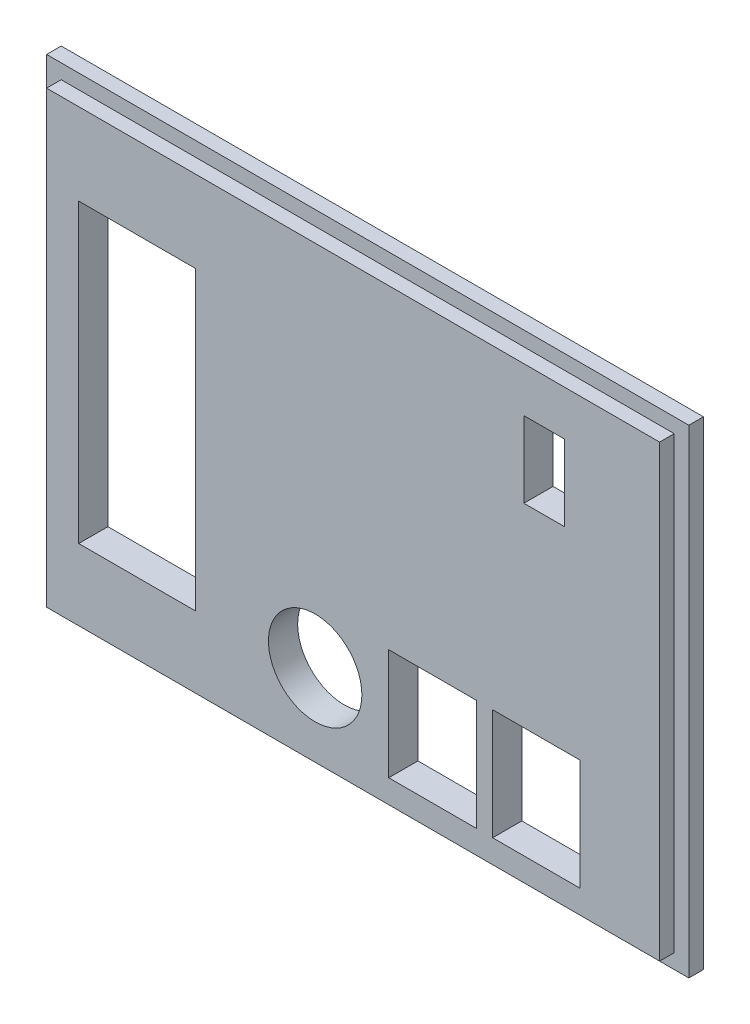
ISO-10303-21;
HEADER;
FILE_DESCRIPTION(('STEP AP214'),'2;1');
FILE_NAME('part.step','',(''),(''),'','','');
FILE_SCHEMA(('AUTOMOTIVE_DESIGN { 1 0 10303 214 1 1 1 1 }'));
ENDSEC;
DATA;
#1=APPLICATION_CONTEXT('core data for automotive mechanical design processes');
#2=APPLICATION_PROTOCOL_DEFINITION('international standard','automotive_design',2000,#1);
#3=PRODUCT_CONTEXT('',#1,'mechanical');
#4=PRODUCT('Part','Part','',(#3));
#5=PRODUCT_RELATED_PRODUCT_CATEGORY('part','',(#4));
#6=PRODUCT_DEFINITION_FORMATION('','',#4);
#7=PRODUCT_DEFINITION_CONTEXT('part definition',#1,'design');
#8=PRODUCT_DEFINITION('design','',#6,#7);
#9=PRODUCT_DEFINITION_SHAPE('','',#8);
#10=(LENGTH_UNIT() NAMED_UNIT(*) SI_UNIT(.MILLI.,.METRE.));
#11=(NAMED_UNIT(*) PLANE_ANGLE_UNIT() SI_UNIT($,.RADIAN.));
#12=(NAMED_UNIT(*) SI_UNIT($,.STERADIAN.) SOLID_ANGLE_UNIT());
#13=UNCERTAINTY_MEASURE_WITH_UNIT(LENGTH_MEASURE(1.E-05),#10,'distance_accuracy_value','');
#14=(GEOMETRIC_REPRESENTATION_CONTEXT(3) GLOBAL_UNCERTAINTY_ASSIGNED_CONTEXT((#13)) GLOBAL_UNIT_ASSIGNED_CONTEXT((#10,
#11,#12)) REPRESENTATION_CONTEXT('',''));
#15=CARTESIAN_POINT('',(0.,0.,0.));
#16=DIRECTION('',(0.,0.,1.));
#17=DIRECTION('',(1.,0.,0.));
#18=AXIS2_PLACEMENT_3D('',#15,#16,#17);
#19=CARTESIAN_POINT('',(0.,0.,5.));
#20=DIRECTION('',(0.,0.,-1.));
#21=DIRECTION('',(-1.,0.,0.));
#22=AXIS2_PLACEMENT_3D('',#19,#20,#21);
#23=PLANE('',#22);
#24=DIRECTION('',(0.,-1.,0.));
#25=VECTOR('',#24,1.);
#26=CARTESIAN_POINT('',(21.1,0.,5.));
#27=LINE('',#26,#25);
#28=CARTESIAN_POINT('',(21.1,-15.4998771673161,5.));
#29=VERTEX_POINT('',#28);
#30=CARTESIAN_POINT('',(21.1,-34.4998771673161,5.));
#31=VERTEX_POINT('',#30);
#32=EDGE_CURVE('E257',#29,#31,#27,.T.);
#33=ORIENTED_EDGE('',*,*,#32,.T.);
#34=DIRECTION('',(1.,0.,0.));
#35=VECTOR('',#34,1.);
#36=CARTESIAN_POINT('',(0.,-34.4998771673161,5.));
#37=LINE('',#36,#35);
#38=CARTESIAN_POINT('',(6.09999999999999,-34.4998771673161,5.));
#39=VERTEX_POINT('',#38);
#40=EDGE_CURVE('E278',#39,#31,#37,.T.);
#41=ORIENTED_EDGE('',*,*,#40,.F.);
#42=DIRECTION('',(0.,-1.,0.));
#43=VECTOR('',#42,1.);
#44=CARTESIAN_POINT('',(6.09999999999999,0.,5.));
#45=LINE('',#44,#43);
#46=CARTESIAN_POINT('',(6.09999999999999,-15.4998771673161,5.));
#47=VERTEX_POINT('',#46);
#48=EDGE_CURVE('E274',#47,#39,#45,.T.);
#49=ORIENTED_EDGE('',*,*,#48,.F.);
#50=DIRECTION('',(1.,0.,0.));
#51=VECTOR('',#50,1.);
#52=CARTESIAN_POINT('',(0.,-15.4998771673161,5.));
#53=LINE('',#52,#51);
#54=EDGE_CURVE('E270',#47,#29,#53,.T.);
#55=ORIENTED_EDGE('',*,*,#54,.T.);
#56=EDGE_LOOP('',(#33,#41,#49,#55));
#57=FACE_BOUND('',#56,.T.);
#58=DIRECTION('',(-1.,0.,0.));
#59=VECTOR('',#58,1.);
#60=CARTESIAN_POINT('',(0.,24.5,5.));
#61=LINE('',#60,#59);
#62=CARTESIAN_POINT('',(-26.9729243703699,24.5,5.));
#63=VERTEX_POINT('',#62);
#64=CARTESIAN_POINT('',(-47.,24.5,5.));
#65=VERTEX_POINT('',#64);
#66=EDGE_CURVE('E371',#63,#65,#61,.T.);
#67=ORIENTED_EDGE('',*,*,#66,.F.);
#68=DIRECTION('',(0.,1.,0.));
#69=VECTOR('',#68,1.);
#70=CARTESIAN_POINT('',(-26.9729243703699,0.,5.));
#71=LINE('',#70,#69);
#72=CARTESIAN_POINT('',(-26.9729243703699,-26.3,5.));
#73=VERTEX_POINT('',#72);
#74=EDGE_CURVE('E347',#73,#63,#71,.T.);
#75=ORIENTED_EDGE('',*,*,#74,.F.);
#76=DIRECTION('',(1.,0.,0.));
#77=VECTOR('',#76,1.);
#78=CARTESIAN_POINT('',(0.,-26.3,5.));
#79=LINE('',#78,#77);
#80=CARTESIAN_POINT('',(-47.,-26.3,5.));
#81=VERTEX_POINT('',#80);
#82=EDGE_CURVE('E356',#81,#73,#79,.T.);
#83=ORIENTED_EDGE('',*,*,#82,.F.);
#84=DIRECTION('',(0.,-1.,0.));
#85=VECTOR('',#84,1.);
#86=CARTESIAN_POINT('',(-47.,0.,5.));
#87=LINE('',#86,#85);
#88=EDGE_CURVE('E375',#65,#81,#87,.T.);
#89=ORIENTED_EDGE('',*,*,#88,.F.);
#90=EDGE_LOOP('',(#67,#75,#83,#89));
#91=FACE_BOUND('',#90,.T.);
#92=DIRECTION('',(-1.,0.,0.));
#93=VECTOR('',#92,1.);
#94=CARTESIAN_POINT('',(-52.5016459675633,-38.4998771673161,5.));
#95=LINE('',#94,#93);
#96=CARTESIAN_POINT('',(52.5,-38.4998771673161,5.));
#97=VERTEX_POINT('',#96);
#98=CARTESIAN_POINT('',(-52.5016459675633,-38.4998771673161,5.));
#99=VERTEX_POINT('',#98);
#100=EDGE_CURVE('E320',#97,#99,#95,.T.);
#101=ORIENTED_EDGE('',*,*,#100,.F.);
#102=DIRECTION('',(0.,-1.,0.));
#103=VECTOR('',#102,1.);
#104=CARTESIAN_POINT('',(52.5,38.4982965441038,5.));
#105=LINE('',#104,#103);
#106=CARTESIAN_POINT('',(52.5,38.4982965441038,5.));
#107=VERTEX_POINT('',#106);
#108=EDGE_CURVE('E286',#107,#97,#105,.T.);
#109=ORIENTED_EDGE('',*,*,#108,.F.);
#110=DIRECTION('',(1.,0.,0.));
#111=VECTOR('',#110,1.);
#112=CARTESIAN_POINT('',(-52.5016459675633,38.4982965441038,5.));
#113=LINE('',#112,#111);
#114=CARTESIAN_POINT('',(-52.5016459675633,38.4982965441038,5.));
#115=VERTEX_POINT('',#114);
#116=EDGE_CURVE('E307',#115,#107,#113,.T.);
#117=ORIENTED_EDGE('',*,*,#116,.F.);
#118=DIRECTION('',(0.,1.,0.));
#119=VECTOR('',#118,1.);
#120=CARTESIAN_POINT('',(-52.5016459675633,41.,5.));
#121=LINE('',#120,#119);
#122=EDGE_CURVE('E333',#99,#115,#121,.T.);
#123=ORIENTED_EDGE('',*,*,#122,.F.);
#124=EDGE_LOOP('',(#101,#109,#117,#123));
#125=FACE_BOUND('',#124,.T.);
#126=DIRECTION('',(0.,-1.,0.));
#127=VECTOR('',#126,1.);
#128=CARTESIAN_POINT('',(38.9,0.,5.));
#129=LINE('',#128,#127);
#130=CARTESIAN_POINT('',(38.9,-15.4998771673161,5.));
#131=VERTEX_POINT('',#130);
#132=CARTESIAN_POINT('',(38.9,-34.4998771673161,5.));
#133=VERTEX_POINT('',#132);
#134=EDGE_CURVE('E241',#131,#133,#129,.T.);
#135=ORIENTED_EDGE('',*,*,#134,.T.);
#136=DIRECTION('',(1.,0.,0.));
#137=VECTOR('',#136,1.);
#138=CARTESIAN_POINT('',(0.,-34.4998771673161,5.));
#139=LINE('',#138,#137);
#140=CARTESIAN_POINT('',(23.9,-34.4998771673161,5.));
#141=VERTEX_POINT('',#140);
#142=EDGE_CURVE('E238',#141,#133,#139,.T.);
#143=ORIENTED_EDGE('',*,*,#142,.F.);
#144=DIRECTION('',(0.,-1.,0.));
#145=VECTOR('',#144,1.);
#146=CARTESIAN_POINT('',(23.9,0.,5.));
#147=LINE('',#146,#145);
#148=CARTESIAN_POINT('',(23.9,-15.4998771673161,5.));
#149=VERTEX_POINT('',#148);
#150=EDGE_CURVE('E249',#149,#141,#147,.T.);
#151=ORIENTED_EDGE('',*,*,#150,.F.);
#152=DIRECTION('',(1.,0.,0.));
#153=VECTOR('',#152,1.);
#154=CARTESIAN_POINT('',(0.,-15.4998771673161,5.));
#155=LINE('',#154,#153);
#156=EDGE_CURVE('E245',#149,#131,#155,.T.);
#157=ORIENTED_EDGE('',*,*,#156,.T.);
#158=EDGE_LOOP('',(#135,#143,#151,#157));
#159=FACE_BOUND('',#158,.T.);
#160=CARTESIAN_POINT('',(-6.50164596756334,-24.4998771673161,5.));
#161=DIRECTION('',(0.,0.,1.));
#162=DIRECTION('',(1.,0.,0.));
#163=AXIS2_PLACEMENT_3D('',#160,#161,#162);
#164=CIRCLE('',#163,8.);
#165=CARTESIAN_POINT('',(1.49835403243666,-24.4998771673161,5.));
#166=VERTEX_POINT('',#165);
#167=EDGE_CURVE('E229',#166,#166,#164,.T.);
#168=ORIENTED_EDGE('',*,*,#167,.F.);
#169=EDGE_LOOP('',(#168));
#170=FACE_BOUND('',#169,.T.);
#171=DIRECTION('',(1.,0.,0.));
#172=VECTOR('',#171,1.);
#173=CARTESIAN_POINT('',(0.,30.7982965441038,5.));
#174=LINE('',#173,#172);
#175=CARTESIAN_POINT('',(29.25,30.7982965441038,5.));
#176=VERTEX_POINT('',#175);
#177=CARTESIAN_POINT('',(36.25,30.7982965441038,5.));
#178=VERTEX_POINT('',#177);
#179=EDGE_CURVE('E54',#176,#178,#174,.T.);
#180=ORIENTED_EDGE('',*,*,#179,.T.);
#181=DIRECTION('',(0.,-1.,0.));
#182=VECTOR('',#181,1.);
#183=CARTESIAN_POINT('',(36.25,0.,5.));
#184=LINE('',#183,#182);
#185=CARTESIAN_POINT('',(36.25,17.7982965441038,5.));
#186=VERTEX_POINT('',#185);
#187=EDGE_CURVE('E219',#178,#186,#184,.T.);
#188=ORIENTED_EDGE('',*,*,#187,.T.);
#189=DIRECTION('',(-1.,0.,0.));
#190=VECTOR('',#189,1.);
#191=CARTESIAN_POINT('',(0.,17.7982965441038,5.));
#192=LINE('',#191,#190);
#193=CARTESIAN_POINT('',(29.25,17.7982965441038,5.));
#194=VERTEX_POINT('',#193);
#195=EDGE_CURVE('E203',#186,#194,#192,.T.);
#196=ORIENTED_EDGE('',*,*,#195,.T.);
#197=DIRECTION('',(0.,1.,0.));
#198=VECTOR('',#197,1.);
#199=CARTESIAN_POINT('',(29.25,0.,5.));
#200=LINE('',#199,#198);
#201=EDGE_CURVE('E213',#194,#176,#200,.T.);
#202=ORIENTED_EDGE('',*,*,#201,.T.);
#203=EDGE_LOOP('',(#180,#188,#196,#202));
#204=FACE_BOUND('',#203,.T.);
#205=ADVANCED_FACE('F38',(#57,#91,#125,#159,#170,#204),#23,.F.);
#206=CARTESIAN_POINT('',(0.,0.,0.));
#207=DIRECTION('',(0.,0.,-1.));
#208=DIRECTION('',(-1.,0.,0.));
#209=AXIS2_PLACEMENT_3D('',#206,#207,#208);
#210=PLANE('',#209);
#211=CARTESIAN_POINT('',(-6.50164596756334,-24.4998771673161,0.));
#212=DIRECTION('',(0.,0.,-1.));
#213=DIRECTION('',(-1.,0.,0.));
#214=AXIS2_PLACEMENT_3D('',#211,#212,#213);
#215=CIRCLE('',#214,8.);
#216=CARTESIAN_POINT('',(-14.5016459675633,-24.4998771673161,0.));
#217=VERTEX_POINT('',#216);
#218=EDGE_CURVE('E237',#217,#217,#215,.T.);
#219=ORIENTED_EDGE('',*,*,#218,.F.);
#220=EDGE_LOOP('',(#219));
#221=FACE_BOUND('',#220,.T.);
#222=DIRECTION('',(-1.,0.,0.));
#223=VECTOR('',#222,1.);
#224=CARTESIAN_POINT('',(0.,-34.4998771673161,0.));
#225=LINE('',#224,#223);
#226=CARTESIAN_POINT('',(38.9,-34.4998771673161,0.));
#227=VERTEX_POINT('',#226);
#228=CARTESIAN_POINT('',(23.9,-34.4998771673161,0.));
#229=VERTEX_POINT('',#228);
#230=EDGE_CURVE('E448',#227,#229,#225,.T.);
#231=ORIENTED_EDGE('',*,*,#230,.F.);
#232=DIRECTION('',(0.,1.,0.));
#233=VECTOR('',#232,1.);
#234=CARTESIAN_POINT('',(38.9,0.,0.));
#235=LINE('',#234,#233);
#236=CARTESIAN_POINT('',(38.9,-15.4998771673161,0.));
#237=VERTEX_POINT('',#236);
#238=EDGE_CURVE('E437',#227,#237,#235,.T.);
#239=ORIENTED_EDGE('',*,*,#238,.T.);
#240=DIRECTION('',(-1.,0.,0.));
#241=VECTOR('',#240,1.);
#242=CARTESIAN_POINT('',(0.,-15.4998771673161,0.));
#243=LINE('',#242,#241);
#244=CARTESIAN_POINT('',(23.9,-15.4998771673161,0.));
#245=VERTEX_POINT('',#244);
#246=EDGE_CURVE('E441',#237,#245,#243,.T.);
#247=ORIENTED_EDGE('',*,*,#246,.T.);
#248=DIRECTION('',(0.,1.,0.));
#249=VECTOR('',#248,1.);
#250=CARTESIAN_POINT('',(23.9,0.,0.));
#251=LINE('',#250,#249);
#252=EDGE_CURVE('E445',#229,#245,#251,.T.);
#253=ORIENTED_EDGE('',*,*,#252,.F.);
#254=EDGE_LOOP('',(#231,#239,#247,#253));
#255=FACE_BOUND('',#254,.T.);
#256=DIRECTION('',(0.,1.,0.));
#257=VECTOR('',#256,1.);
#258=CARTESIAN_POINT('',(-26.9729243703699,0.,0.));
#259=LINE('',#258,#257);
#260=CARTESIAN_POINT('',(-26.9729243703699,-26.3,0.));
#261=VERTEX_POINT('',#260);
#262=CARTESIAN_POINT('',(-26.9729243703699,24.5,0.));
#263=VERTEX_POINT('',#262);
#264=EDGE_CURVE('E351',#261,#263,#259,.T.);
#265=ORIENTED_EDGE('',*,*,#264,.T.);
#266=DIRECTION('',(-1.,0.,0.));
#267=VECTOR('',#266,1.);
#268=CARTESIAN_POINT('',(0.,24.5,0.));
#269=LINE('',#268,#267);
#270=CARTESIAN_POINT('',(-47.,24.5,0.));
#271=VERTEX_POINT('',#270);
#272=EDGE_CURVE('E355',#263,#271,#269,.T.);
#273=ORIENTED_EDGE('',*,*,#272,.T.);
#274=DIRECTION('',(0.,-1.,0.));
#275=VECTOR('',#274,1.);
#276=CARTESIAN_POINT('',(-47.,0.,0.));
#277=LINE('',#276,#275);
#278=CARTESIAN_POINT('',(-47.,-26.3,0.));
#279=VERTEX_POINT('',#278);
#280=EDGE_CURVE('E360',#271,#279,#277,.T.);
#281=ORIENTED_EDGE('',*,*,#280,.T.);
#282=DIRECTION('',(1.,0.,0.));
#283=VECTOR('',#282,1.);
#284=CARTESIAN_POINT('',(0.,-26.3,0.));
#285=LINE('',#284,#283);
#286=EDGE_CURVE('E364',#279,#261,#285,.T.);
#287=ORIENTED_EDGE('',*,*,#286,.T.);
#288=EDGE_LOOP('',(#265,#273,#281,#287));
#289=FACE_BOUND('',#288,.T.);
#290=DIRECTION('',(0.,-1.,0.));
#291=VECTOR('',#290,1.);
#292=CARTESIAN_POINT('',(-55.,41.,0.));
#293=LINE('',#292,#291);
#294=CARTESIAN_POINT('',(-55.,41.,0.));
#295=VERTEX_POINT('',#294);
#296=CARTESIAN_POINT('',(-55.,-41.,0.));
#297=VERTEX_POINT('',#296);
#298=EDGE_CURVE('E385',#295,#297,#293,.T.);
#299=ORIENTED_EDGE('',*,*,#298,.F.);
#300=DIRECTION('',(-1.,0.,0.));
#301=VECTOR('',#300,1.);
#302=CARTESIAN_POINT('',(55.,41.,0.));
#303=LINE('',#302,#301);
#304=CARTESIAN_POINT('',(55.,41.,0.));
#305=VERTEX_POINT('',#304);
#306=EDGE_CURVE('E406',#305,#295,#303,.T.);
#307=ORIENTED_EDGE('',*,*,#306,.F.);
#308=DIRECTION('',(0.,1.,0.));
#309=VECTOR('',#308,1.);
#310=CARTESIAN_POINT('',(55.,41.,0.));
#311=LINE('',#310,#309);
#312=CARTESIAN_POINT('',(55.,-41.,0.));
#313=VERTEX_POINT('',#312);
#314=EDGE_CURVE('E402',#313,#305,#311,.T.);
#315=ORIENTED_EDGE('',*,*,#314,.F.);
#316=DIRECTION('',(1.,0.,0.));
#317=VECTOR('',#316,1.);
#318=CARTESIAN_POINT('',(55.,-41.,0.));
#319=LINE('',#318,#317);
#320=EDGE_CURVE('E398',#297,#313,#319,.T.);
#321=ORIENTED_EDGE('',*,*,#320,.F.);
#322=EDGE_LOOP('',(#299,#307,#315,#321));
#323=FACE_BOUND('',#322,.T.);
#324=DIRECTION('',(-1.,0.,0.));
#325=VECTOR('',#324,1.);
#326=CARTESIAN_POINT('',(0.,-34.4998771673161,0.));
#327=LINE('',#326,#325);
#328=CARTESIAN_POINT('',(21.1,-34.4998771673161,0.));
#329=VERTEX_POINT('',#328);
#330=CARTESIAN_POINT('',(6.09999999999999,-34.4998771673161,0.));
#331=VERTEX_POINT('',#330);
#332=EDGE_CURVE('E430',#329,#331,#327,.T.);
#333=ORIENTED_EDGE('',*,*,#332,.F.);
#334=DIRECTION('',(0.,1.,0.));
#335=VECTOR('',#334,1.);
#336=CARTESIAN_POINT('',(21.1,0.,0.));
#337=LINE('',#336,#335);
#338=CARTESIAN_POINT('',(21.1,-15.4998771673161,0.));
#339=VERTEX_POINT('',#338);
#340=EDGE_CURVE('E433',#329,#339,#337,.T.);
#341=ORIENTED_EDGE('',*,*,#340,.T.);
#342=DIRECTION('',(-1.,0.,0.));
#343=VECTOR('',#342,1.);
#344=CARTESIAN_POINT('',(0.,-15.4998771673161,0.));
#345=LINE('',#344,#343);
#346=CARTESIAN_POINT('',(6.09999999999999,-15.4998771673161,0.));
#347=VERTEX_POINT('',#346);
#348=EDGE_CURVE('E422',#339,#347,#345,.T.);
#349=ORIENTED_EDGE('',*,*,#348,.T.);
#350=DIRECTION('',(0.,1.,0.));
#351=VECTOR('',#350,1.);
#352=CARTESIAN_POINT('',(6.09999999999999,0.,0.));
#353=LINE('',#352,#351);
#354=EDGE_CURVE('E426',#331,#347,#353,.T.);
#355=ORIENTED_EDGE('',*,*,#354,.F.);
#356=EDGE_LOOP('',(#333,#341,#349,#355));
#357=FACE_BOUND('',#356,.T.);
#358=DIRECTION('',(0.,1.,0.));
#359=VECTOR('',#358,1.);
#360=CARTESIAN_POINT('',(36.25,0.,0.));
#361=LINE('',#360,#359);
#362=CARTESIAN_POINT('',(36.25,17.7982965441038,0.));
#363=VERTEX_POINT('',#362);
#364=CARTESIAN_POINT('',(36.25,30.7982965441038,0.));
#365=VERTEX_POINT('',#364);
#366=EDGE_CURVE('E47',#363,#365,#361,.T.);
#367=ORIENTED_EDGE('',*,*,#366,.T.);
#368=DIRECTION('',(-1.,0.,0.));
#369=VECTOR('',#368,1.);
#370=CARTESIAN_POINT('',(0.,30.7982965441038,0.));
#371=LINE('',#370,#369);
#372=CARTESIAN_POINT('',(29.25,30.7982965441038,0.));
#373=VERTEX_POINT('',#372);
#374=EDGE_CURVE('E11',#365,#373,#371,.T.);
#375=ORIENTED_EDGE('',*,*,#374,.T.);
#376=DIRECTION('',(0.,-1.,0.));
#377=VECTOR('',#376,1.);
#378=CARTESIAN_POINT('',(29.25,0.,0.));
#379=LINE('',#378,#377);
#380=CARTESIAN_POINT('',(29.25,17.7982965441038,0.));
#381=VERTEX_POINT('',#380);
#382=EDGE_CURVE('E451',#373,#381,#379,.T.);
#383=ORIENTED_EDGE('',*,*,#382,.T.);
#384=DIRECTION('',(1.,0.,0.));
#385=VECTOR('',#384,1.);
#386=CARTESIAN_POINT('',(0.,17.7982965441038,0.));
#387=LINE('',#386,#385);
#388=EDGE_CURVE('E206',#381,#363,#387,.T.);
#389=ORIENTED_EDGE('',*,*,#388,.T.);
#390=EDGE_LOOP('',(#367,#375,#383,#389));
#391=FACE_BOUND('',#390,.T.);
#392=ADVANCED_FACE('F461',(#221,#255,#289,#323,#357,#391),#210,.T.);
#393=CARTESIAN_POINT('',(55.,41.,5.));
#394=DIRECTION('',(-1.,0.,0.));
#395=DIRECTION('',(0.,0.,1.));
#396=AXIS2_PLACEMENT_3D('',#393,#394,#395);
#397=PLANE('',#396);
#398=DIRECTION('',(0.,0.,-1.));
#399=VECTOR('',#398,1.);
#400=CARTESIAN_POINT('',(55.,41.,5.));
#401=LINE('',#400,#399);
#402=CARTESIAN_POINT('',(55.,41.,2.5));
#403=VERTEX_POINT('',#402);
#404=EDGE_CURVE('E413',#403,#305,#401,.T.);
#405=ORIENTED_EDGE('',*,*,#404,.F.);
#406=DIRECTION('',(0.,1.,0.));
#407=VECTOR('',#406,1.);
#408=CARTESIAN_POINT('',(55.,-38.4998771673161,2.5));
#409=LINE('',#408,#407);
#410=CARTESIAN_POINT('',(55.,-41.,2.5));
#411=VERTEX_POINT('',#410);
#412=EDGE_CURVE('E321',#411,#403,#409,.T.);
#413=ORIENTED_EDGE('',*,*,#412,.F.);
#414=DIRECTION('',(0.,0.,-1.));
#415=VECTOR('',#414,1.);
#416=CARTESIAN_POINT('',(55.,-41.,5.));
#417=LINE('',#416,#415);
#418=EDGE_CURVE('E416',#411,#313,#417,.T.);
#419=ORIENTED_EDGE('',*,*,#418,.T.);
#420=ORIENTED_EDGE('',*,*,#314,.T.);
#421=EDGE_LOOP('',(#405,#413,#419,#420));
#422=FACE_BOUND('',#421,.T.);
#423=ADVANCED_FACE('F484',(#422),#397,.F.);
#424=CARTESIAN_POINT('',(55.,41.,5.));
#425=DIRECTION('',(0.,-1.,0.));
#426=DIRECTION('',(0.,0.,-1.));
#427=AXIS2_PLACEMENT_3D('',#424,#425,#426);
#428=PLANE('',#427);
#429=DIRECTION('',(-1.,0.,0.));
#430=VECTOR('',#429,1.);
#431=CARTESIAN_POINT('',(-55.,41.,2.5));
#432=LINE('',#431,#430);
#433=CARTESIAN_POINT('',(-55.,41.,2.5));
#434=VERTEX_POINT('',#433);
#435=EDGE_CURVE('E344',#403,#434,#432,.T.);
#436=ORIENTED_EDGE('',*,*,#435,.F.);
#437=ORIENTED_EDGE('',*,*,#404,.T.);
#438=ORIENTED_EDGE('',*,*,#306,.T.);
#439=DIRECTION('',(0.,0.,-1.));
#440=VECTOR('',#439,1.);
#441=CARTESIAN_POINT('',(-55.,41.,5.));
#442=LINE('',#441,#440);
#443=EDGE_CURVE('E410',#434,#295,#442,.T.);
#444=ORIENTED_EDGE('',*,*,#443,.F.);
#445=EDGE_LOOP('',(#436,#437,#438,#444));
#446=FACE_BOUND('',#445,.T.);
#447=ADVANCED_FACE('F492',(#446),#428,.F.);
#448=CARTESIAN_POINT('',(-55.,41.,5.));
#449=DIRECTION('',(1.,0.,0.));
#450=DIRECTION('',(0.,0.,-1.));
#451=AXIS2_PLACEMENT_3D('',#448,#449,#450);
#452=PLANE('',#451);
#453=DIRECTION('',(0.,0.,-1.));
#454=VECTOR('',#453,1.);
#455=CARTESIAN_POINT('',(-55.,-41.,5.));
#456=LINE('',#455,#454);
#457=CARTESIAN_POINT('',(-55.,-41.,2.5));
#458=VERTEX_POINT('',#457);
#459=EDGE_CURVE('E419',#458,#297,#456,.T.);
#460=ORIENTED_EDGE('',*,*,#459,.F.);
#461=DIRECTION('',(0.,-1.,0.));
#462=VECTOR('',#461,1.);
#463=CARTESIAN_POINT('',(-55.,-41.,2.5));
#464=LINE('',#463,#462);
#465=EDGE_CURVE('E334',#434,#458,#464,.T.);
#466=ORIENTED_EDGE('',*,*,#465,.F.);
#467=ORIENTED_EDGE('',*,*,#443,.T.);
#468=ORIENTED_EDGE('',*,*,#298,.T.);
#469=EDGE_LOOP('',(#460,#466,#467,#468));
#470=FACE_BOUND('',#469,.T.);
#471=ADVANCED_FACE('F40',(#470),#452,.F.);
#472=CARTESIAN_POINT('',(55.,-41.,5.));
#473=DIRECTION('',(0.,1.,0.));
#474=DIRECTION('',(0.,0.,1.));
#475=AXIS2_PLACEMENT_3D('',#472,#473,#474);
#476=PLANE('',#475);
#477=ORIENTED_EDGE('',*,*,#418,.F.);
#478=DIRECTION('',(1.,0.,0.));
#479=VECTOR('',#478,1.);
#480=CARTESIAN_POINT('',(-52.5016459675633,-41.,2.5));
#481=LINE('',#480,#479);
#482=EDGE_CURVE('E337',#458,#411,#481,.T.);
#483=ORIENTED_EDGE('',*,*,#482,.F.);
#484=ORIENTED_EDGE('',*,*,#459,.T.);
#485=ORIENTED_EDGE('',*,*,#320,.T.);
#486=EDGE_LOOP('',(#477,#483,#484,#485));
#487=FACE_BOUND('',#486,.T.);
#488=ADVANCED_FACE('F498',(#487),#476,.F.);
#489=CARTESIAN_POINT('',(-26.9729243703699,0.,0.));
#490=DIRECTION('',(1.,0.,0.));
#491=DIRECTION('',(0.,0.,-1.));
#492=AXIS2_PLACEMENT_3D('',#489,#490,#491);
#493=PLANE('',#492);
#494=ORIENTED_EDGE('',*,*,#74,.T.);
#495=DIRECTION('',(0.,0.,1.));
#496=VECTOR('',#495,1.);
#497=CARTESIAN_POINT('',(-26.9729243703699,24.5,0.));
#498=LINE('',#497,#496);
#499=EDGE_CURVE('E368',#263,#63,#498,.T.);
#500=ORIENTED_EDGE('',*,*,#499,.F.);
#501=ORIENTED_EDGE('',*,*,#264,.F.);
#502=DIRECTION('',(0.,0.,1.));
#503=VECTOR('',#502,1.);
#504=CARTESIAN_POINT('',(-26.9729243703699,-26.3,0.));
#505=LINE('',#504,#503);
#506=EDGE_CURVE('E382',#261,#73,#505,.T.);
#507=ORIENTED_EDGE('',*,*,#506,.T.);
#508=EDGE_LOOP('',(#494,#500,#501,#507));
#509=FACE_BOUND('',#508,.T.);
#510=ADVANCED_FACE('F489',(#509),#493,.F.);
#511=CARTESIAN_POINT('',(0.,-26.3,0.));
#512=DIRECTION('',(0.,-1.,0.));
#513=DIRECTION('',(0.,0.,-1.));
#514=AXIS2_PLACEMENT_3D('',#511,#512,#513);
#515=PLANE('',#514);
#516=ORIENTED_EDGE('',*,*,#82,.T.);
#517=ORIENTED_EDGE('',*,*,#506,.F.);
#518=ORIENTED_EDGE('',*,*,#286,.F.);
#519=DIRECTION('',(0.,0.,1.));
#520=VECTOR('',#519,1.);
#521=CARTESIAN_POINT('',(-47.,-26.3,0.));
#522=LINE('',#521,#520);
#523=EDGE_CURVE('E386',#279,#81,#522,.T.);
#524=ORIENTED_EDGE('',*,*,#523,.T.);
#525=EDGE_LOOP('',(#516,#517,#518,#524));
#526=FACE_BOUND('',#525,.T.);
#527=ADVANCED_FACE('F505',(#526),#515,.F.);
#528=CARTESIAN_POINT('',(-47.,0.,0.));
#529=DIRECTION('',(-1.,0.,0.));
#530=DIRECTION('',(0.,0.,1.));
#531=AXIS2_PLACEMENT_3D('',#528,#529,#530);
#532=PLANE('',#531);
#533=ORIENTED_EDGE('',*,*,#88,.T.);
#534=ORIENTED_EDGE('',*,*,#523,.F.);
#535=ORIENTED_EDGE('',*,*,#280,.F.);
#536=DIRECTION('',(0.,0.,1.));
#537=VECTOR('',#536,1.);
#538=CARTESIAN_POINT('',(-47.,24.5,0.));
#539=LINE('',#538,#537);
#540=EDGE_CURVE('E389',#271,#65,#539,.T.);
#541=ORIENTED_EDGE('',*,*,#540,.T.);
#542=EDGE_LOOP('',(#533,#534,#535,#541));
#543=FACE_BOUND('',#542,.T.);
#544=ADVANCED_FACE('F577',(#543),#532,.F.);
#545=CARTESIAN_POINT('',(0.,24.5,0.));
#546=DIRECTION('',(0.,1.,0.));
#547=DIRECTION('',(0.,0.,1.));
#548=AXIS2_PLACEMENT_3D('',#545,#546,#547);
#549=PLANE('',#548);
#550=ORIENTED_EDGE('',*,*,#66,.T.);
#551=ORIENTED_EDGE('',*,*,#540,.F.);
#552=ORIENTED_EDGE('',*,*,#272,.F.);
#553=ORIENTED_EDGE('',*,*,#499,.T.);
#554=EDGE_LOOP('',(#550,#551,#552,#553));
#555=FACE_BOUND('',#554,.T.);
#556=ADVANCED_FACE('F573',(#555),#549,.F.);
#557=CARTESIAN_POINT('',(-52.5016459675633,41.,2.5));
#558=DIRECTION('',(1.,0.,0.));
#559=DIRECTION('',(0.,0.,-1.));
#560=AXIS2_PLACEMENT_3D('',#557,#558,#559);
#561=PLANE('',#560);
#562=ORIENTED_EDGE('',*,*,#122,.T.);
#563=DIRECTION('',(0.,0.,1.));
#564=VECTOR('',#563,1.);
#565=CARTESIAN_POINT('',(-52.5016459675633,38.4982965441038,2.5));
#566=LINE('',#565,#564);
#567=CARTESIAN_POINT('',(-52.5016459675633,38.4982965441038,2.5));
#568=VERTEX_POINT('',#567);
#569=EDGE_CURVE('E314',#568,#115,#566,.T.);
#570=ORIENTED_EDGE('',*,*,#569,.F.);
#571=DIRECTION('',(0.,1.,0.));
#572=VECTOR('',#571,1.);
#573=CARTESIAN_POINT('',(-52.5016459675633,41.,2.5));
#574=LINE('',#573,#572);
#575=CARTESIAN_POINT('',(-52.5016459675633,-38.499877167316,2.5));
#576=VERTEX_POINT('',#575);
#577=EDGE_CURVE('E340',#576,#568,#574,.T.);
#578=ORIENTED_EDGE('',*,*,#577,.F.);
#579=DIRECTION('',(0.,0.,1.));
#580=VECTOR('',#579,1.);
#581=CARTESIAN_POINT('',(-52.5016459675633,-38.4998771673161,2.5));
#582=LINE('',#581,#580);
#583=EDGE_CURVE('E327',#576,#99,#582,.T.);
#584=ORIENTED_EDGE('',*,*,#583,.T.);
#585=EDGE_LOOP('',(#562,#570,#578,#584));
#586=FACE_BOUND('',#585,.T.);
#587=ADVANCED_FACE('F569',(#586),#561,.F.);
#588=CARTESIAN_POINT('',(0.,0.,2.5));
#589=DIRECTION('',(0.,0.,-1.));
#590=DIRECTION('',(-1.,0.,0.));
#591=AXIS2_PLACEMENT_3D('',#588,#589,#590);
#592=PLANE('',#591);
#593=DIRECTION('',(0.,-1.,0.));
#594=VECTOR('',#593,1.);
#595=CARTESIAN_POINT('',(52.5,38.4982965441038,2.5));
#596=LINE('',#595,#594);
#597=CARTESIAN_POINT('',(52.5,38.4982965441038,2.5));
#598=VERTEX_POINT('',#597);
#599=CARTESIAN_POINT('',(52.5,-38.4998771673161,2.5));
#600=VERTEX_POINT('',#599);
#601=EDGE_CURVE('E296',#598,#600,#596,.T.);
#602=ORIENTED_EDGE('',*,*,#601,.T.);
#603=DIRECTION('',(-1.,0.,0.));
#604=VECTOR('',#603,1.);
#605=CARTESIAN_POINT('',(-52.5016459675633,-38.4998771673161,2.5));
#606=LINE('',#605,#604);
#607=EDGE_CURVE('E324',#600,#576,#606,.T.);
#608=ORIENTED_EDGE('',*,*,#607,.T.);
#609=ORIENTED_EDGE('',*,*,#577,.T.);
#610=DIRECTION('',(1.,0.,0.));
#611=VECTOR('',#610,1.);
#612=CARTESIAN_POINT('',(-52.5016459675633,38.4982965441038,2.5));
#613=LINE('',#612,#611);
#614=EDGE_CURVE('E310',#568,#598,#613,.T.);
#615=ORIENTED_EDGE('',*,*,#614,.T.);
#616=EDGE_LOOP('',(#602,#608,#609,#615));
#617=FACE_BOUND('',#616,.T.);
#618=ORIENTED_EDGE('',*,*,#465,.T.);
#619=ORIENTED_EDGE('',*,*,#482,.T.);
#620=ORIENTED_EDGE('',*,*,#412,.T.);
#621=ORIENTED_EDGE('',*,*,#435,.T.);
#622=EDGE_LOOP('',(#618,#619,#620,#621));
#623=FACE_BOUND('',#622,.T.);
#624=ADVANCED_FACE('F518',(#617,#623),#592,.F.);
#625=CARTESIAN_POINT('',(-52.5016459675633,-38.4998771673161,2.5));
#626=DIRECTION('',(0.,1.,0.));
#627=DIRECTION('',(0.,0.,1.));
#628=AXIS2_PLACEMENT_3D('',#625,#626,#627);
#629=PLANE('',#628);
#630=ORIENTED_EDGE('',*,*,#607,.F.);
#631=DIRECTION('',(0.,0.,1.));
#632=VECTOR('',#631,1.);
#633=CARTESIAN_POINT('',(52.5,-38.4998771673161,2.5));
#634=LINE('',#633,#632);
#635=EDGE_CURVE('E303',#600,#97,#634,.T.);
#636=ORIENTED_EDGE('',*,*,#635,.T.);
#637=ORIENTED_EDGE('',*,*,#100,.T.);
#638=ORIENTED_EDGE('',*,*,#583,.F.);
#639=EDGE_LOOP('',(#630,#636,#637,#638));
#640=FACE_BOUND('',#639,.T.);
#641=ADVANCED_FACE('F562',(#640),#629,.F.);
#642=CARTESIAN_POINT('',(-52.5016459675633,38.4982965441038,2.5));
#643=DIRECTION('',(0.,-1.,0.));
#644=DIRECTION('',(0.,0.,-1.));
#645=AXIS2_PLACEMENT_3D('',#642,#643,#644);
#646=PLANE('',#645);
#647=ORIENTED_EDGE('',*,*,#116,.T.);
#648=DIRECTION('',(0.,0.,1.));
#649=VECTOR('',#648,1.);
#650=CARTESIAN_POINT('',(52.5,38.4982965441038,2.5));
#651=LINE('',#650,#649);
#652=EDGE_CURVE('E300',#598,#107,#651,.T.);
#653=ORIENTED_EDGE('',*,*,#652,.F.);
#654=ORIENTED_EDGE('',*,*,#614,.F.);
#655=ORIENTED_EDGE('',*,*,#569,.T.);
#656=EDGE_LOOP('',(#647,#653,#654,#655));
#657=FACE_BOUND('',#656,.T.);
#658=ADVANCED_FACE('F558',(#657),#646,.F.);
#659=CARTESIAN_POINT('',(52.5,38.4982965441038,2.5));
#660=DIRECTION('',(-1.,0.,0.));
#661=DIRECTION('',(0.,-1.,0.));
#662=AXIS2_PLACEMENT_3D('',#659,#660,#661);
#663=PLANE('',#662);
#664=ORIENTED_EDGE('',*,*,#108,.T.);
#665=ORIENTED_EDGE('',*,*,#635,.F.);
#666=ORIENTED_EDGE('',*,*,#601,.F.);
#667=ORIENTED_EDGE('',*,*,#652,.T.);
#668=EDGE_LOOP('',(#664,#665,#666,#667));
#669=FACE_BOUND('',#668,.T.);
#670=ADVANCED_FACE('F555',(#669),#663,.F.);
#671=CARTESIAN_POINT('',(21.1,0.,-5.));
#672=DIRECTION('',(-1.,0.,0.));
#673=DIRECTION('',(0.,-1.,0.));
#674=AXIS2_PLACEMENT_3D('',#671,#672,#673);
#675=PLANE('',#674);
#676=DIRECTION('',(0.,0.,1.));
#677=VECTOR('',#676,1.);
#678=CARTESIAN_POINT('',(21.1,-34.4998771673161,-5.));
#679=LINE('',#678,#677);
#680=EDGE_CURVE('E283',#329,#31,#679,.T.);
#681=ORIENTED_EDGE('',*,*,#680,.T.);
#682=ORIENTED_EDGE('',*,*,#32,.F.);
#683=DIRECTION('',(0.,0.,1.));
#684=VECTOR('',#683,1.);
#685=CARTESIAN_POINT('',(21.1,-15.4998771673161,-5.));
#686=LINE('',#685,#684);
#687=EDGE_CURVE('E282',#339,#29,#686,.T.);
#688=ORIENTED_EDGE('',*,*,#687,.F.);
#689=ORIENTED_EDGE('',*,*,#340,.F.);
#690=EDGE_LOOP('',(#681,#682,#688,#689));
#691=FACE_BOUND('',#690,.T.);
#692=ADVANCED_FACE('F537',(#691),#675,.T.);
#693=CARTESIAN_POINT('',(0.,-34.4998771673161,-5.));
#694=DIRECTION('',(0.,-1.,0.));
#695=DIRECTION('',(0.,0.,-1.));
#696=AXIS2_PLACEMENT_3D('',#693,#694,#695);
#697=PLANE('',#696);
#698=ORIENTED_EDGE('',*,*,#332,.T.);
#699=DIRECTION('',(0.,0.,1.));
#700=VECTOR('',#699,1.);
#701=CARTESIAN_POINT('',(6.09999999999999,-34.4998771673161,-5.));
#702=LINE('',#701,#700);
#703=EDGE_CURVE('E287',#331,#39,#702,.T.);
#704=ORIENTED_EDGE('',*,*,#703,.T.);
#705=ORIENTED_EDGE('',*,*,#40,.T.);
#706=ORIENTED_EDGE('',*,*,#680,.F.);
#707=EDGE_LOOP('',(#698,#704,#705,#706));
#708=FACE_BOUND('',#707,.T.);
#709=ADVANCED_FACE('F529',(#708),#697,.F.);
#710=CARTESIAN_POINT('',(6.09999999999999,0.,-5.));
#711=DIRECTION('',(-1.,0.,0.));
#712=DIRECTION('',(0.,-1.,0.));
#713=AXIS2_PLACEMENT_3D('',#710,#711,#712);
#714=PLANE('',#713);
#715=ORIENTED_EDGE('',*,*,#354,.T.);
#716=DIRECTION('',(0.,0.,1.));
#717=VECTOR('',#716,1.);
#718=CARTESIAN_POINT('',(6.09999999999999,-15.4998771673161,-5.));
#719=LINE('',#718,#717);
#720=EDGE_CURVE('E290',#347,#47,#719,.T.);
#721=ORIENTED_EDGE('',*,*,#720,.T.);
#722=ORIENTED_EDGE('',*,*,#48,.T.);
#723=ORIENTED_EDGE('',*,*,#703,.F.);
#724=EDGE_LOOP('',(#715,#721,#722,#723));
#725=FACE_BOUND('',#724,.T.);
#726=ADVANCED_FACE('F531',(#725),#714,.F.);
#727=CARTESIAN_POINT('',(0.,-15.4998771673161,-5.));
#728=DIRECTION('',(0.,-1.,0.));
#729=DIRECTION('',(0.,0.,-1.));
#730=AXIS2_PLACEMENT_3D('',#727,#728,#729);
#731=PLANE('',#730);
#732=ORIENTED_EDGE('',*,*,#687,.T.);
#733=ORIENTED_EDGE('',*,*,#54,.F.);
#734=ORIENTED_EDGE('',*,*,#720,.F.);
#735=ORIENTED_EDGE('',*,*,#348,.F.);
#736=EDGE_LOOP('',(#732,#733,#734,#735));
#737=FACE_BOUND('',#736,.T.);
#738=ADVANCED_FACE('F539',(#737),#731,.T.);
#739=CARTESIAN_POINT('',(0.,-34.4998771673161,-5.));
#740=DIRECTION('',(0.,-1.,0.));
#741=DIRECTION('',(0.,0.,-1.));
#742=AXIS2_PLACEMENT_3D('',#739,#740,#741);
#743=PLANE('',#742);
#744=ORIENTED_EDGE('',*,*,#230,.T.);
#745=DIRECTION('',(0.,0.,1.));
#746=VECTOR('',#745,1.);
#747=CARTESIAN_POINT('',(23.9,-34.4998771673161,-5.));
#748=LINE('',#747,#746);
#749=EDGE_CURVE('E254',#229,#141,#748,.T.);
#750=ORIENTED_EDGE('',*,*,#749,.T.);
#751=ORIENTED_EDGE('',*,*,#142,.T.);
#752=DIRECTION('',(0.,0.,1.));
#753=VECTOR('',#752,1.);
#754=CARTESIAN_POINT('',(38.9,-34.4998771673161,-5.));
#755=LINE('',#754,#753);
#756=EDGE_CURVE('E253',#227,#133,#755,.T.);
#757=ORIENTED_EDGE('',*,*,#756,.F.);
#758=EDGE_LOOP('',(#744,#750,#751,#757));
#759=FACE_BOUND('',#758,.T.);
#760=ADVANCED_FACE('F541',(#759),#743,.F.);
#761=CARTESIAN_POINT('',(23.9,0.,-5.));
#762=DIRECTION('',(-1.,0.,0.));
#763=DIRECTION('',(0.,0.,1.));
#764=AXIS2_PLACEMENT_3D('',#761,#762,#763);
#765=PLANE('',#764);
#766=ORIENTED_EDGE('',*,*,#252,.T.);
#767=DIRECTION('',(0.,0.,1.));
#768=VECTOR('',#767,1.);
#769=CARTESIAN_POINT('',(23.9,-15.4998771673161,-5.));
#770=LINE('',#769,#768);
#771=EDGE_CURVE('E258',#245,#149,#770,.T.);
#772=ORIENTED_EDGE('',*,*,#771,.T.);
#773=ORIENTED_EDGE('',*,*,#150,.T.);
#774=ORIENTED_EDGE('',*,*,#749,.F.);
#775=EDGE_LOOP('',(#766,#772,#773,#774));
#776=FACE_BOUND('',#775,.T.);
#777=ADVANCED_FACE('F547',(#776),#765,.F.);
#778=CARTESIAN_POINT('',(0.,-15.4998771673161,-5.));
#779=DIRECTION('',(0.,-1.,0.));
#780=DIRECTION('',(0.,0.,-1.));
#781=AXIS2_PLACEMENT_3D('',#778,#779,#780);
#782=PLANE('',#781);
#783=DIRECTION('',(0.,0.,1.));
#784=VECTOR('',#783,1.);
#785=CARTESIAN_POINT('',(38.9,-15.4998771673161,-5.));
#786=LINE('',#785,#784);
#787=EDGE_CURVE('E261',#237,#131,#786,.T.);
#788=ORIENTED_EDGE('',*,*,#787,.T.);
#789=ORIENTED_EDGE('',*,*,#156,.F.);
#790=ORIENTED_EDGE('',*,*,#771,.F.);
#791=ORIENTED_EDGE('',*,*,#246,.F.);
#792=EDGE_LOOP('',(#788,#789,#790,#791));
#793=FACE_BOUND('',#792,.T.);
#794=ADVANCED_FACE('F616',(#793),#782,.T.);
#795=CARTESIAN_POINT('',(38.9,0.,-5.));
#796=DIRECTION('',(-1.,0.,0.));
#797=DIRECTION('',(0.,0.,1.));
#798=AXIS2_PLACEMENT_3D('',#795,#796,#797);
#799=PLANE('',#798);
#800=ORIENTED_EDGE('',*,*,#756,.T.);
#801=ORIENTED_EDGE('',*,*,#134,.F.);
#802=ORIENTED_EDGE('',*,*,#787,.F.);
#803=ORIENTED_EDGE('',*,*,#238,.F.);
#804=EDGE_LOOP('',(#800,#801,#802,#803));
#805=FACE_BOUND('',#804,.T.);
#806=ADVANCED_FACE('F474',(#805),#799,.T.);
#807=CARTESIAN_POINT('',(-6.50164596756334,-24.4998771673161,-3.));
#808=DIRECTION('',(0.,0.,1.));
#809=DIRECTION('',(1.,0.,0.));
#810=AXIS2_PLACEMENT_3D('',#807,#808,#809);
#811=CYLINDRICAL_SURFACE('',#810,8.);
#812=ORIENTED_EDGE('',*,*,#218,.T.);
#813=EDGE_LOOP('',(#812));
#814=FACE_BOUND('',#813,.T.);
#815=ORIENTED_EDGE('',*,*,#167,.T.);
#816=EDGE_LOOP('',(#815));
#817=FACE_BOUND('',#816,.T.);
#818=ADVANCED_FACE('F467',(#814,#817),#811,.F.);
#819=CARTESIAN_POINT('',(0.,30.7982965441038,-5.));
#820=DIRECTION('',(0.,-1.,0.));
#821=DIRECTION('',(0.,0.,-1.));
#822=AXIS2_PLACEMENT_3D('',#819,#820,#821);
#823=PLANE('',#822);
#824=DIRECTION('',(0.,0.,1.));
#825=VECTOR('',#824,1.);
#826=CARTESIAN_POINT('',(36.25,30.7982965441038,-5.));
#827=LINE('',#826,#825);
#828=EDGE_CURVE('E226',#365,#178,#827,.T.);
#829=ORIENTED_EDGE('',*,*,#828,.T.);
#830=ORIENTED_EDGE('',*,*,#179,.F.);
#831=DIRECTION('',(0.,0.,1.));
#832=VECTOR('',#831,1.);
#833=CARTESIAN_POINT('',(29.25,30.7982965441038,-5.));
#834=LINE('',#833,#832);
#835=EDGE_CURVE('E210',#373,#176,#834,.T.);
#836=ORIENTED_EDGE('',*,*,#835,.F.);
#837=ORIENTED_EDGE('',*,*,#374,.F.);
#838=EDGE_LOOP('',(#829,#830,#836,#837));
#839=FACE_BOUND('',#838,.T.);
#840=ADVANCED_FACE('F465',(#839),#823,.T.);
#841=CARTESIAN_POINT('',(36.25,0.,-5.));
#842=DIRECTION('',(-1.,0.,0.));
#843=DIRECTION('',(0.,0.,1.));
#844=AXIS2_PLACEMENT_3D('',#841,#842,#843);
#845=PLANE('',#844);
#846=DIRECTION('',(0.,0.,1.));
#847=VECTOR('',#846,1.);
#848=CARTESIAN_POINT('',(36.25,17.7982965441038,-5.));
#849=LINE('',#848,#847);
#850=EDGE_CURVE('E209',#363,#186,#849,.T.);
#851=ORIENTED_EDGE('',*,*,#850,.T.);
#852=ORIENTED_EDGE('',*,*,#187,.F.);
#853=ORIENTED_EDGE('',*,*,#828,.F.);
#854=ORIENTED_EDGE('',*,*,#366,.F.);
#855=EDGE_LOOP('',(#851,#852,#853,#854));
#856=FACE_BOUND('',#855,.T.);
#857=ADVANCED_FACE('F464',(#856),#845,.T.);
#858=CARTESIAN_POINT('',(0.,17.7982965441038,-5.));
#859=DIRECTION('',(0.,1.,0.));
#860=DIRECTION('',(0.,0.,1.));
#861=AXIS2_PLACEMENT_3D('',#858,#859,#860);
#862=PLANE('',#861);
#863=DIRECTION('',(0.,0.,1.));
#864=VECTOR('',#863,1.);
#865=CARTESIAN_POINT('',(29.25,17.7982965441038,-5.));
#866=LINE('',#865,#864);
#867=EDGE_CURVE('E62',#381,#194,#866,.T.);
#868=ORIENTED_EDGE('',*,*,#867,.T.);
#869=ORIENTED_EDGE('',*,*,#195,.F.);
#870=ORIENTED_EDGE('',*,*,#850,.F.);
#871=ORIENTED_EDGE('',*,*,#388,.F.);
#872=EDGE_LOOP('',(#868,#869,#870,#871));
#873=FACE_BOUND('',#872,.T.);
#874=ADVANCED_FACE('F200',(#873),#862,.T.);
#875=CARTESIAN_POINT('',(29.25,0.,-5.));
#876=DIRECTION('',(1.,0.,0.));
#877=DIRECTION('',(0.,0.,-1.));
#878=AXIS2_PLACEMENT_3D('',#875,#876,#877);
#879=PLANE('',#878);
#880=ORIENTED_EDGE('',*,*,#835,.T.);
#881=ORIENTED_EDGE('',*,*,#201,.F.);
#882=ORIENTED_EDGE('',*,*,#867,.F.);
#883=ORIENTED_EDGE('',*,*,#382,.F.);
#884=EDGE_LOOP('',(#880,#881,#882,#883));
#885=FACE_BOUND('',#884,.T.);
#886=ADVANCED_FACE('F214',(#885),#879,.T.);
#887=CLOSED_SHELL('',(#205,#392,#423,#447,#471,#488,#510,#527,#544,#556,#587,#624,#641,#658,
#670,#692,#709,#726,#738,#760,#777,#794,#806,#818,#840,#857,#874,#886));
#888=MANIFOLD_SOLID_BREP('B2',#887);
#889=ADVANCED_BREP_SHAPE_REPRESENTATION('',(#18,#888),#14);
#890=SHAPE_DEFINITION_REPRESENTATION(#9,#889);
ENDSEC;
END-ISO-10303-21;
